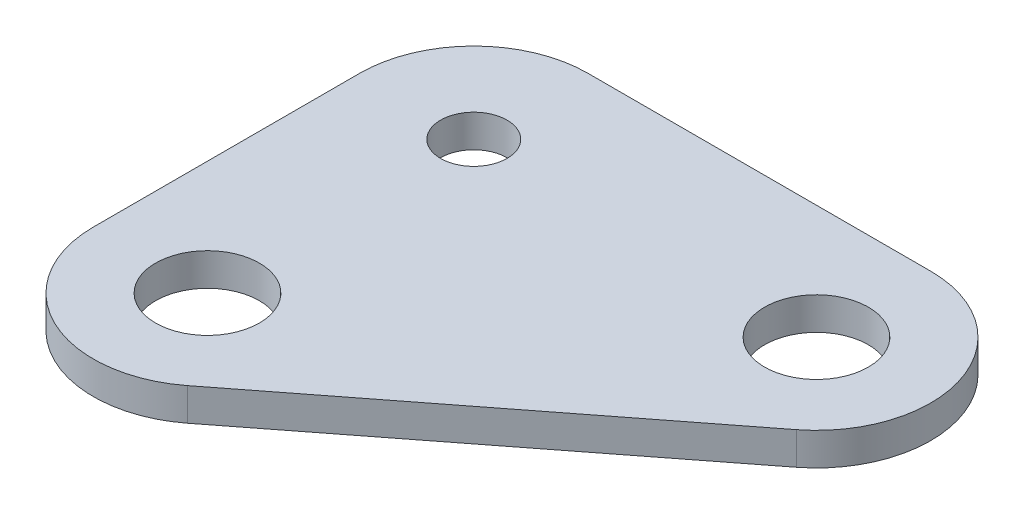
ISO-10303-21;
HEADER;
FILE_DESCRIPTION(('STEP AP214'),'2;1');
FILE_NAME('part.step','',(''),(''),'','','');
FILE_SCHEMA(('AUTOMOTIVE_DESIGN { 1 0 10303 214 1 1 1 1 }'));
ENDSEC;
DATA;
#1=APPLICATION_CONTEXT('core data for automotive mechanical design processes');
#2=APPLICATION_PROTOCOL_DEFINITION('international standard','automotive_design',2000,#1);
#3=PRODUCT_CONTEXT('',#1,'mechanical');
#4=PRODUCT('Part','Part','',(#3));
#5=PRODUCT_RELATED_PRODUCT_CATEGORY('part','',(#4));
#6=PRODUCT_DEFINITION_FORMATION('','',#4);
#7=PRODUCT_DEFINITION_CONTEXT('part definition',#1,'design');
#8=PRODUCT_DEFINITION('design','',#6,#7);
#9=PRODUCT_DEFINITION_SHAPE('','',#8);
#10=(LENGTH_UNIT() NAMED_UNIT(*) SI_UNIT(.MILLI.,.METRE.));
#11=(NAMED_UNIT(*) PLANE_ANGLE_UNIT() SI_UNIT($,.RADIAN.));
#12=(NAMED_UNIT(*) SI_UNIT($,.STERADIAN.) SOLID_ANGLE_UNIT());
#13=UNCERTAINTY_MEASURE_WITH_UNIT(LENGTH_MEASURE(1.E-05),#10,'distance_accuracy_value','');
#14=(GEOMETRIC_REPRESENTATION_CONTEXT(3) GLOBAL_UNCERTAINTY_ASSIGNED_CONTEXT((#13)) GLOBAL_UNIT_ASSIGNED_CONTEXT((#10,
#11,#12)) REPRESENTATION_CONTEXT('',''));
#15=CARTESIAN_POINT('',(0.,0.,0.));
#16=DIRECTION('',(0.,0.,1.));
#17=DIRECTION('',(1.,0.,0.));
#18=AXIS2_PLACEMENT_3D('',#15,#16,#17);
#19=CARTESIAN_POINT('',(0.,0.,0.));
#20=DIRECTION('',(0.,-1.,0.));
#21=DIRECTION('',(1.,0.,0.));
#22=AXIS2_PLACEMENT_3D('',#19,#20,#21);
#23=PLANE('',#22);
#24=CARTESIAN_POINT('',(0.,0.,0.));
#25=DIRECTION('',(0.,-1.,0.));
#26=DIRECTION('',(1.,0.,0.));
#27=AXIS2_PLACEMENT_3D('',#24,#25,#26);
#28=CIRCLE('',#27,2.5);
#29=CARTESIAN_POINT('',(2.5,0.,0.));
#30=VERTEX_POINT('',#29);
#31=EDGE_CURVE('E113',#30,#30,#28,.F.);
#32=ORIENTED_EDGE('',*,*,#31,.T.);
#33=EDGE_LOOP('',(#32));
#34=FACE_BOUND('',#33,.T.);
#35=CARTESIAN_POINT('',(-2.22044604925031E-13,0.,-12.825));
#36=DIRECTION('',(0.,-1.,0.));
#37=DIRECTION('',(1.,0.,0.));
#38=AXIS2_PLACEMENT_3D('',#35,#36,#37);
#39=CIRCLE('',#38,1.6);
#40=CARTESIAN_POINT('',(1.59999999999978,0.,-12.825));
#41=VERTEX_POINT('',#40);
#42=EDGE_CURVE('E119',#41,#41,#39,.F.);
#43=ORIENTED_EDGE('',*,*,#42,.T.);
#44=EDGE_LOOP('',(#43));
#45=FACE_BOUND('',#44,.T.);
#46=CARTESIAN_POINT('',(16.4999999999999,0.,-12.8250000000001));
#47=DIRECTION('',(0.,-1.,0.));
#48=DIRECTION('',(1.,0.,0.));
#49=AXIS2_PLACEMENT_3D('',#46,#47,#48);
#50=CIRCLE('',#49,5.5);
#51=CARTESIAN_POINT('',(19.8753066861339,0.,-8.48250016988622));
#52=VERTEX_POINT('',#51);
#53=CARTESIAN_POINT('',(16.4999999999999,0.,-18.325));
#54=VERTEX_POINT('',#53);
#55=EDGE_CURVE('E97',#52,#54,#50,.F.);
#56=ORIENTED_EDGE('',*,*,#55,.F.);
#57=DIRECTION('',(-0.789545423657072,0.,0.613692124751633));
#58=VECTOR('',#57,1.);
#59=CARTESIAN_POINT('',(19.8753066861339,0.,-8.48250016988622));
#60=LINE('',#59,#58);
#61=CARTESIAN_POINT('',(3.37530668613393,0.,4.34249983011383));
#62=VERTEX_POINT('',#61);
#63=EDGE_CURVE('E94',#52,#62,#60,.T.);
#64=ORIENTED_EDGE('',*,*,#63,.T.);
#65=CARTESIAN_POINT('',(0.,0.,0.));
#66=DIRECTION('',(0.,-1.,0.));
#67=DIRECTION('',(1.,0.,0.));
#68=AXIS2_PLACEMENT_3D('',#65,#66,#67);
#69=CIRCLE('',#68,5.5);
#70=CARTESIAN_POINT('',(-5.49999999999997,0.,0.));
#71=VERTEX_POINT('',#70);
#72=EDGE_CURVE('E81',#71,#62,#69,.F.);
#73=ORIENTED_EDGE('',*,*,#72,.F.);
#74=DIRECTION('',(0.,0.,-1.));
#75=VECTOR('',#74,1.);
#76=CARTESIAN_POINT('',(-5.49999999999995,0.,0.));
#77=LINE('',#76,#75);
#78=CARTESIAN_POINT('',(-5.50000000000009,0.,-12.825));
#79=VERTEX_POINT('',#78);
#80=EDGE_CURVE('E77',#71,#79,#77,.T.);
#81=ORIENTED_EDGE('',*,*,#80,.T.);
#82=CARTESIAN_POINT('',(-2.22044604925031E-13,0.,-12.825));
#83=DIRECTION('',(0.,-1.,0.));
#84=DIRECTION('',(1.,0.,0.));
#85=AXIS2_PLACEMENT_3D('',#82,#83,#84);
#86=CIRCLE('',#85,5.5);
#87=CARTESIAN_POINT('',(-2.2262284608369E-13,0.,-18.325));
#88=VERTEX_POINT('',#87);
#89=EDGE_CURVE('E20',#88,#79,#86,.F.);
#90=ORIENTED_EDGE('',*,*,#89,.F.);
#91=DIRECTION('',(1.,0.,0.));
#92=VECTOR('',#91,1.);
#93=CARTESIAN_POINT('',(-2.22044604925031E-13,0.,-18.325));
#94=LINE('',#93,#92);
#95=EDGE_CURVE('E90',#88,#54,#94,.T.);
#96=ORIENTED_EDGE('',*,*,#95,.T.);
#97=EDGE_LOOP('',(#56,#64,#73,#81,#90,#96));
#98=FACE_BOUND('',#97,.T.);
#99=CARTESIAN_POINT('',(16.4999999999999,0.,-12.8250000000001));
#100=DIRECTION('',(0.,-1.,0.));
#101=DIRECTION('',(1.,0.,0.));
#102=AXIS2_PLACEMENT_3D('',#99,#100,#101);
#103=CIRCLE('',#102,2.5);
#104=CARTESIAN_POINT('',(18.9999999999999,0.,-12.8250000000001));
#105=VERTEX_POINT('',#104);
#106=EDGE_CURVE('E116',#105,#105,#103,.F.);
#107=ORIENTED_EDGE('',*,*,#106,.T.);
#108=EDGE_LOOP('',(#107));
#109=FACE_BOUND('',#108,.T.);
#110=ADVANCED_FACE('F17',(#34,#45,#98,#109),#23,.T.);
#111=CARTESIAN_POINT('',(-5.49999999999995,1.56999999999996,0.));
#112=DIRECTION('',(1.,0.,0.));
#113=DIRECTION('',(0.,0.,-1.));
#114=AXIS2_PLACEMENT_3D('',#111,#112,#113);
#115=PLANE('',#114);
#116=DIRECTION('',(0.,-1.,0.));
#117=VECTOR('',#116,1.);
#118=CARTESIAN_POINT('',(-5.5,1.56999999999996,0.));
#119=LINE('',#118,#117);
#120=CARTESIAN_POINT('',(-5.49999999999997,1.56999999999996,0.));
#121=VERTEX_POINT('',#120);
#122=EDGE_CURVE('E122',#121,#71,#119,.T.);
#123=ORIENTED_EDGE('',*,*,#122,.F.);
#124=DIRECTION('',(0.,0.,1.));
#125=VECTOR('',#124,1.);
#126=CARTESIAN_POINT('',(-5.49999999999995,1.56999999999996,0.));
#127=LINE('',#126,#125);
#128=CARTESIAN_POINT('',(-5.50000000000009,1.56999999999996,-12.825));
#129=VERTEX_POINT('',#128);
#130=EDGE_CURVE('E88',#121,#129,#127,.F.);
#131=ORIENTED_EDGE('',*,*,#130,.T.);
#132=DIRECTION('',(0.,-1.,0.));
#133=VECTOR('',#132,1.);
#134=CARTESIAN_POINT('',(-5.50000000000022,1.56999999999996,-12.825));
#135=LINE('',#134,#133);
#136=EDGE_CURVE('E74',#79,#129,#135,.F.);
#137=ORIENTED_EDGE('',*,*,#136,.F.);
#138=ORIENTED_EDGE('',*,*,#80,.F.);
#139=EDGE_LOOP('',(#123,#131,#137,#138));
#140=FACE_BOUND('',#139,.T.);
#141=ADVANCED_FACE('F87',(#140),#115,.F.);
#142=CARTESIAN_POINT('',(-2.22044604925031E-13,1.56999999999996,-12.825));
#143=DIRECTION('',(0.,-1.,0.));
#144=DIRECTION('',(1.,0.,0.));
#145=AXIS2_PLACEMENT_3D('',#142,#143,#144);
#146=CYLINDRICAL_SURFACE('',#145,5.5);
#147=CARTESIAN_POINT('',(-2.22044604925031E-13,1.56999999999996,-12.825));
#148=DIRECTION('',(0.,-1.,0.));
#149=DIRECTION('',(1.,0.,0.));
#150=AXIS2_PLACEMENT_3D('',#147,#148,#149);
#151=CIRCLE('',#150,5.5);
#152=CARTESIAN_POINT('',(-2.22044604925031E-13,1.56999999999996,-18.325));
#153=VERTEX_POINT('',#152);
#154=EDGE_CURVE('E111',#129,#153,#151,.T.);
#155=ORIENTED_EDGE('',*,*,#154,.T.);
#156=DIRECTION('',(0.,1.,0.));
#157=VECTOR('',#156,1.);
#158=CARTESIAN_POINT('',(-2.22044604925031E-13,1.56999999999996,-18.325));
#159=LINE('',#158,#157);
#160=EDGE_CURVE('E76',#153,#88,#159,.F.);
#161=ORIENTED_EDGE('',*,*,#160,.T.);
#162=ORIENTED_EDGE('',*,*,#89,.T.);
#163=ORIENTED_EDGE('',*,*,#136,.T.);
#164=EDGE_LOOP('',(#155,#161,#162,#163));
#165=FACE_BOUND('',#164,.T.);
#166=ADVANCED_FACE('F72',(#165),#146,.T.);
#167=CARTESIAN_POINT('',(-2.22044604925031E-13,1.56999999999996,-18.325));
#168=DIRECTION('',(0.,0.,1.));
#169=DIRECTION('',(1.,0.,0.));
#170=AXIS2_PLACEMENT_3D('',#167,#168,#169);
#171=PLANE('',#170);
#172=ORIENTED_EDGE('',*,*,#160,.F.);
#173=DIRECTION('',(1.,0.,0.));
#174=VECTOR('',#173,1.);
#175=CARTESIAN_POINT('',(0.,1.56999999999996,-18.325));
#176=LINE('',#175,#174);
#177=CARTESIAN_POINT('',(16.4999999999999,1.56999999999996,-18.325));
#178=VERTEX_POINT('',#177);
#179=EDGE_CURVE('E110',#153,#178,#176,.T.);
#180=ORIENTED_EDGE('',*,*,#179,.T.);
#181=DIRECTION('',(0.,-1.,0.));
#182=VECTOR('',#181,1.);
#183=CARTESIAN_POINT('',(16.4999999999999,1.56999999999996,-18.3250000000001));
#184=LINE('',#183,#182);
#185=EDGE_CURVE('E123',#54,#178,#184,.F.);
#186=ORIENTED_EDGE('',*,*,#185,.F.);
#187=ORIENTED_EDGE('',*,*,#95,.F.);
#188=EDGE_LOOP('',(#172,#180,#186,#187));
#189=FACE_BOUND('',#188,.T.);
#190=ADVANCED_FACE('F145',(#189),#171,.F.);
#191=CARTESIAN_POINT('',(16.4999999999999,1.56999999999996,-12.8250000000001));
#192=DIRECTION('',(0.,-1.,0.));
#193=DIRECTION('',(1.,0.,0.));
#194=AXIS2_PLACEMENT_3D('',#191,#192,#193);
#195=CYLINDRICAL_SURFACE('',#194,5.5);
#196=CARTESIAN_POINT('',(16.4999999999999,1.56999999999996,-12.8250000000001));
#197=DIRECTION('',(0.,-1.,0.));
#198=DIRECTION('',(1.,0.,0.));
#199=AXIS2_PLACEMENT_3D('',#196,#197,#198);
#200=CIRCLE('',#199,5.5);
#201=CARTESIAN_POINT('',(19.8753066861339,1.56999999999996,-8.48250016988623));
#202=VERTEX_POINT('',#201);
#203=EDGE_CURVE('E107',#178,#202,#200,.T.);
#204=ORIENTED_EDGE('',*,*,#203,.T.);
#205=DIRECTION('',(0.,1.,0.));
#206=VECTOR('',#205,1.);
#207=CARTESIAN_POINT('',(19.8753066861339,1.56999999999996,-8.48250016988622));
#208=LINE('',#207,#206);
#209=EDGE_CURVE('E96',#202,#52,#208,.F.);
#210=ORIENTED_EDGE('',*,*,#209,.T.);
#211=ORIENTED_EDGE('',*,*,#55,.T.);
#212=ORIENTED_EDGE('',*,*,#185,.T.);
#213=EDGE_LOOP('',(#204,#210,#211,#212));
#214=FACE_BOUND('',#213,.T.);
#215=ADVANCED_FACE('F143',(#214),#195,.T.);
#216=CARTESIAN_POINT('',(19.8753066861339,1.56999999999996,-8.48250016988622));
#217=DIRECTION('',(-0.613692124751633,0.,-0.789545423657072));
#218=DIRECTION('',(-0.789545423657072,0.,0.613692124751633));
#219=AXIS2_PLACEMENT_3D('',#216,#217,#218);
#220=PLANE('',#219);
#221=ORIENTED_EDGE('',*,*,#209,.F.);
#222=DIRECTION('',(-0.789545423657068,0.,0.613692124751638));
#223=VECTOR('',#222,1.);
#224=CARTESIAN_POINT('',(19.8753066861339,1.56999999999996,-8.48250016988622));
#225=LINE('',#224,#223);
#226=CARTESIAN_POINT('',(3.37530668613398,1.56999999999996,4.34249983011387));
#227=VERTEX_POINT('',#226);
#228=EDGE_CURVE('E106',#202,#227,#225,.T.);
#229=ORIENTED_EDGE('',*,*,#228,.T.);
#230=DIRECTION('',(0.,-1.,0.));
#231=VECTOR('',#230,1.);
#232=CARTESIAN_POINT('',(3.37530668613398,1.56999999999996,4.3424998301139));
#233=LINE('',#232,#231);
#234=EDGE_CURVE('E35',#62,#227,#233,.F.);
#235=ORIENTED_EDGE('',*,*,#234,.F.);
#236=ORIENTED_EDGE('',*,*,#63,.F.);
#237=EDGE_LOOP('',(#221,#229,#235,#236));
#238=FACE_BOUND('',#237,.T.);
#239=ADVANCED_FACE('F138',(#238),#220,.F.);
#240=CARTESIAN_POINT('',(0.,1.56999999999996,0.));
#241=DIRECTION('',(0.,-1.,0.));
#242=DIRECTION('',(1.,0.,0.));
#243=AXIS2_PLACEMENT_3D('',#240,#241,#242);
#244=CYLINDRICAL_SURFACE('',#243,5.5);
#245=CARTESIAN_POINT('',(0.,1.56999999999996,0.));
#246=DIRECTION('',(0.,-1.,0.));
#247=DIRECTION('',(1.,0.,0.));
#248=AXIS2_PLACEMENT_3D('',#245,#246,#247);
#249=CIRCLE('',#248,5.5);
#250=EDGE_CURVE('E104',#227,#121,#249,.T.);
#251=ORIENTED_EDGE('',*,*,#250,.T.);
#252=ORIENTED_EDGE('',*,*,#122,.T.);
#253=ORIENTED_EDGE('',*,*,#72,.T.);
#254=ORIENTED_EDGE('',*,*,#234,.T.);
#255=EDGE_LOOP('',(#251,#252,#253,#254));
#256=FACE_BOUND('',#255,.T.);
#257=ADVANCED_FACE('F152',(#256),#244,.T.);
#258=CARTESIAN_POINT('',(-2.22044604925031E-13,1.56999999999996,-12.825));
#259=DIRECTION('',(0.,-1.,0.));
#260=DIRECTION('',(1.,0.,0.));
#261=AXIS2_PLACEMENT_3D('',#258,#259,#260);
#262=CYLINDRICAL_SURFACE('',#261,1.6);
#263=ORIENTED_EDGE('',*,*,#42,.F.);
#264=EDGE_LOOP('',(#263));
#265=FACE_BOUND('',#264,.T.);
#266=CARTESIAN_POINT('',(-2.22044604925031E-13,1.56999999999996,-12.825));
#267=DIRECTION('',(0.,-1.,0.));
#268=DIRECTION('',(1.,0.,0.));
#269=AXIS2_PLACEMENT_3D('',#266,#267,#268);
#270=CIRCLE('',#269,1.6);
#271=CARTESIAN_POINT('',(1.59999999999978,1.56999999999996,-12.825));
#272=VERTEX_POINT('',#271);
#273=EDGE_CURVE('E101',#272,#272,#270,.F.);
#274=ORIENTED_EDGE('',*,*,#273,.T.);
#275=EDGE_LOOP('',(#274));
#276=FACE_BOUND('',#275,.T.);
#277=ADVANCED_FACE('F171',(#265,#276),#262,.F.);
#278=CARTESIAN_POINT('',(16.4999999999999,1.56999999999996,-12.8250000000001));
#279=DIRECTION('',(0.,-1.,0.));
#280=DIRECTION('',(1.,0.,0.));
#281=AXIS2_PLACEMENT_3D('',#278,#279,#280);
#282=CYLINDRICAL_SURFACE('',#281,2.5);
#283=ORIENTED_EDGE('',*,*,#106,.F.);
#284=EDGE_LOOP('',(#283));
#285=FACE_BOUND('',#284,.T.);
#286=CARTESIAN_POINT('',(16.4999999999999,1.56999999999996,-12.8250000000001));
#287=DIRECTION('',(0.,-1.,0.));
#288=DIRECTION('',(1.,0.,0.));
#289=AXIS2_PLACEMENT_3D('',#286,#287,#288);
#290=CIRCLE('',#289,2.5);
#291=CARTESIAN_POINT('',(18.9999999999999,1.56999999999996,-12.8250000000001));
#292=VERTEX_POINT('',#291);
#293=EDGE_CURVE('E26',#292,#292,#290,.F.);
#294=ORIENTED_EDGE('',*,*,#293,.T.);
#295=EDGE_LOOP('',(#294));
#296=FACE_BOUND('',#295,.T.);
#297=ADVANCED_FACE('F163',(#285,#296),#282,.F.);
#298=CARTESIAN_POINT('',(0.,1.56999999999996,0.));
#299=DIRECTION('',(0.,-1.,0.));
#300=DIRECTION('',(1.,0.,0.));
#301=AXIS2_PLACEMENT_3D('',#298,#299,#300);
#302=CYLINDRICAL_SURFACE('',#301,2.5);
#303=ORIENTED_EDGE('',*,*,#31,.F.);
#304=EDGE_LOOP('',(#303));
#305=FACE_BOUND('',#304,.T.);
#306=CARTESIAN_POINT('',(0.,1.56999999999996,0.));
#307=DIRECTION('',(0.,-1.,0.));
#308=DIRECTION('',(1.,0.,0.));
#309=AXIS2_PLACEMENT_3D('',#306,#307,#308);
#310=CIRCLE('',#309,2.5);
#311=CARTESIAN_POINT('',(2.5,1.56999999999996,0.));
#312=VERTEX_POINT('',#311);
#313=EDGE_CURVE('E11',#312,#312,#310,.F.);
#314=ORIENTED_EDGE('',*,*,#313,.T.);
#315=EDGE_LOOP('',(#314));
#316=FACE_BOUND('',#315,.T.);
#317=ADVANCED_FACE('F157',(#305,#316),#302,.F.);
#318=CARTESIAN_POINT('',(0.,1.56999999999996,0.));
#319=DIRECTION('',(0.,-1.,0.));
#320=DIRECTION('',(1.,0.,0.));
#321=AXIS2_PLACEMENT_3D('',#318,#319,#320);
#322=PLANE('',#321);
#323=ORIENTED_EDGE('',*,*,#313,.F.);
#324=EDGE_LOOP('',(#323));
#325=FACE_BOUND('',#324,.T.);
#326=ORIENTED_EDGE('',*,*,#293,.F.);
#327=EDGE_LOOP('',(#326));
#328=FACE_BOUND('',#327,.T.);
#329=ORIENTED_EDGE('',*,*,#273,.F.);
#330=EDGE_LOOP('',(#329));
#331=FACE_BOUND('',#330,.T.);
#332=ORIENTED_EDGE('',*,*,#228,.F.);
#333=ORIENTED_EDGE('',*,*,#203,.F.);
#334=ORIENTED_EDGE('',*,*,#179,.F.);
#335=ORIENTED_EDGE('',*,*,#154,.F.);
#336=ORIENTED_EDGE('',*,*,#130,.F.);
#337=ORIENTED_EDGE('',*,*,#250,.F.);
#338=EDGE_LOOP('',(#332,#333,#334,#335,#336,#337));
#339=FACE_BOUND('',#338,.T.);
#340=ADVANCED_FACE('F141',(#325,#328,#331,#339),#322,.F.);
#341=CLOSED_SHELL('',(#110,#141,#166,#190,#215,#239,#257,#277,#297,#317,#340));
#342=MANIFOLD_SOLID_BREP('B1',#341);
#343=ADVANCED_BREP_SHAPE_REPRESENTATION('',(#18,#342),#14);
#344=SHAPE_DEFINITION_REPRESENTATION(#9,#343);
ENDSEC;
END-ISO-10303-21;
